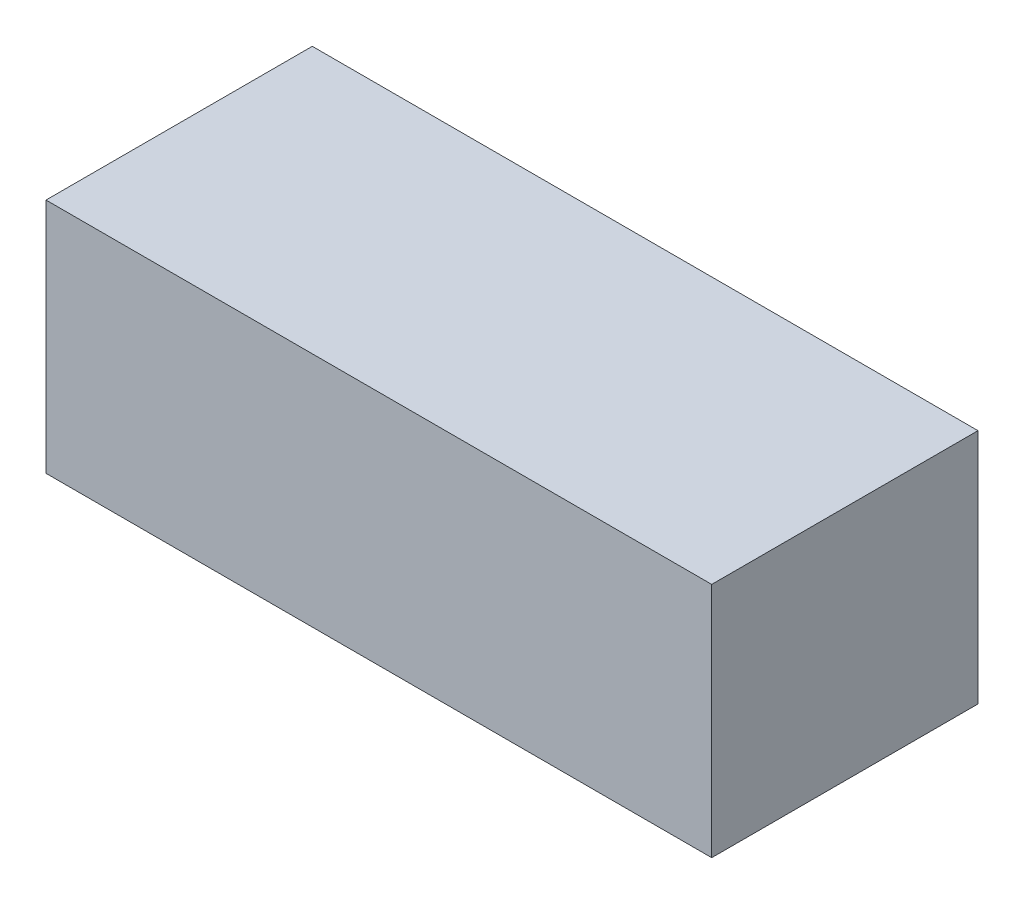
ISO-10303-21;
HEADER;
FILE_DESCRIPTION(('STEP AP214'),'2;1');
FILE_NAME('part.step','',(''),(''),'','','');
FILE_SCHEMA(('AUTOMOTIVE_DESIGN { 1 0 10303 214 1 1 1 1 }'));
ENDSEC;
DATA;
#1=APPLICATION_CONTEXT('core data for automotive mechanical design processes');
#2=APPLICATION_PROTOCOL_DEFINITION('international standard','automotive_design',2000,#1);
#3=PRODUCT_CONTEXT('',#1,'mechanical');
#4=PRODUCT('Part','Part','',(#3));
#5=PRODUCT_RELATED_PRODUCT_CATEGORY('part','',(#4));
#6=PRODUCT_DEFINITION_FORMATION('','',#4);
#7=PRODUCT_DEFINITION_CONTEXT('part definition',#1,'design');
#8=PRODUCT_DEFINITION('design','',#6,#7);
#9=PRODUCT_DEFINITION_SHAPE('','',#8);
#10=(LENGTH_UNIT() NAMED_UNIT(*) SI_UNIT(.MILLI.,.METRE.));
#11=(NAMED_UNIT(*) PLANE_ANGLE_UNIT() SI_UNIT($,.RADIAN.));
#12=(NAMED_UNIT(*) SI_UNIT($,.STERADIAN.) SOLID_ANGLE_UNIT());
#13=UNCERTAINTY_MEASURE_WITH_UNIT(LENGTH_MEASURE(1.E-05),#10,'distance_accuracy_value','');
#14=(GEOMETRIC_REPRESENTATION_CONTEXT(3) GLOBAL_UNCERTAINTY_ASSIGNED_CONTEXT((#13)) GLOBAL_UNIT_ASSIGNED_CONTEXT((#10,
#11,#12)) REPRESENTATION_CONTEXT('',''));
#15=CARTESIAN_POINT('',(0.,0.,0.));
#16=DIRECTION('',(0.,0.,1.));
#17=DIRECTION('',(1.,0.,0.));
#18=AXIS2_PLACEMENT_3D('',#15,#16,#17);
#19=CARTESIAN_POINT('',(2.251,-0.8,1.801));
#20=DIRECTION('',(0.,-1.,0.));
#21=DIRECTION('',(-1.,0.,0.));
#22=AXIS2_PLACEMENT_3D('',#19,#20,#21);
#23=PLANE('',#22);
#24=DIRECTION('',(0.,0.,1.));
#25=VECTOR('',#24,1.);
#26=CARTESIAN_POINT('',(-2.25,-0.8,0.9));
#27=LINE('',#26,#25);
#28=CARTESIAN_POINT('',(-2.25,-0.8,0.));
#29=VERTEX_POINT('',#28);
#30=CARTESIAN_POINT('',(-2.25,-0.8,1.8));
#31=VERTEX_POINT('',#30);
#32=EDGE_CURVE('E20',#29,#31,#27,.T.);
#33=ORIENTED_EDGE('',*,*,#32,.F.);
#34=DIRECTION('',(-1.,0.,0.));
#35=VECTOR('',#34,1.);
#36=CARTESIAN_POINT('',(0.,-0.8,0.));
#37=LINE('',#36,#35);
#38=CARTESIAN_POINT('',(2.25,-0.8,0.));
#39=VERTEX_POINT('',#38);
#40=EDGE_CURVE('E80',#39,#29,#37,.T.);
#41=ORIENTED_EDGE('',*,*,#40,.F.);
#42=DIRECTION('',(0.,0.,-1.));
#43=VECTOR('',#42,1.);
#44=CARTESIAN_POINT('',(2.25,-0.8,0.9));
#45=LINE('',#44,#43);
#46=CARTESIAN_POINT('',(2.25,-0.8,1.8));
#47=VERTEX_POINT('',#46);
#48=EDGE_CURVE('E68',#47,#39,#45,.T.);
#49=ORIENTED_EDGE('',*,*,#48,.F.);
#50=DIRECTION('',(1.,0.,0.));
#51=VECTOR('',#50,1.);
#52=CARTESIAN_POINT('',(0.,-0.8,1.8));
#53=LINE('',#52,#51);
#54=EDGE_CURVE('E55',#31,#47,#53,.T.);
#55=ORIENTED_EDGE('',*,*,#54,.F.);
#56=EDGE_LOOP('',(#33,#41,#49,#55));
#57=FACE_BOUND('',#56,.T.);
#58=ADVANCED_FACE('F16',(#57),#23,.T.);
#59=CARTESIAN_POINT('',(-2.25,-0.801,1.801));
#60=DIRECTION('',(-1.,0.,0.));
#61=DIRECTION('',(0.,1.,0.));
#62=AXIS2_PLACEMENT_3D('',#59,#60,#61);
#63=PLANE('',#62);
#64=DIRECTION('',(0.,0.,1.));
#65=VECTOR('',#64,1.);
#66=CARTESIAN_POINT('',(-2.25,0.8,0.9));
#67=LINE('',#66,#65);
#68=CARTESIAN_POINT('',(-2.25,0.8,0.));
#69=VERTEX_POINT('',#68);
#70=CARTESIAN_POINT('',(-2.25,0.8,1.8));
#71=VERTEX_POINT('',#70);
#72=EDGE_CURVE('E83',#69,#71,#67,.T.);
#73=ORIENTED_EDGE('',*,*,#72,.F.);
#74=DIRECTION('',(0.,1.,0.));
#75=VECTOR('',#74,1.);
#76=CARTESIAN_POINT('',(-2.25,0.,0.));
#77=LINE('',#76,#75);
#78=EDGE_CURVE('E64',#29,#69,#77,.T.);
#79=ORIENTED_EDGE('',*,*,#78,.F.);
#80=ORIENTED_EDGE('',*,*,#32,.T.);
#81=DIRECTION('',(0.,-1.,0.));
#82=VECTOR('',#81,1.);
#83=CARTESIAN_POINT('',(-2.25,0.,1.8));
#84=LINE('',#83,#82);
#85=EDGE_CURVE('E61',#71,#31,#84,.T.);
#86=ORIENTED_EDGE('',*,*,#85,.F.);
#87=EDGE_LOOP('',(#73,#79,#80,#86));
#88=FACE_BOUND('',#87,.T.);
#89=ADVANCED_FACE('F60',(#88),#63,.T.);
#90=CARTESIAN_POINT('',(-2.251,-0.801,1.8));
#91=DIRECTION('',(0.,0.,1.));
#92=DIRECTION('',(1.,0.,0.));
#93=AXIS2_PLACEMENT_3D('',#90,#91,#92);
#94=PLANE('',#93);
#95=ORIENTED_EDGE('',*,*,#54,.T.);
#96=DIRECTION('',(0.,-1.,0.));
#97=VECTOR('',#96,1.);
#98=CARTESIAN_POINT('',(2.25,0.,1.8));
#99=LINE('',#98,#97);
#100=CARTESIAN_POINT('',(2.25,0.8,1.8));
#101=VERTEX_POINT('',#100);
#102=EDGE_CURVE('E70',#101,#47,#99,.T.);
#103=ORIENTED_EDGE('',*,*,#102,.F.);
#104=DIRECTION('',(1.,0.,0.));
#105=VECTOR('',#104,1.);
#106=CARTESIAN_POINT('',(0.,0.8,1.8));
#107=LINE('',#106,#105);
#108=EDGE_CURVE('E74',#71,#101,#107,.T.);
#109=ORIENTED_EDGE('',*,*,#108,.F.);
#110=ORIENTED_EDGE('',*,*,#85,.T.);
#111=EDGE_LOOP('',(#95,#103,#109,#110));
#112=FACE_BOUND('',#111,.T.);
#113=ADVANCED_FACE('F72',(#112),#94,.T.);
#114=CARTESIAN_POINT('',(2.25,0.801,1.801));
#115=DIRECTION('',(1.,0.,0.));
#116=DIRECTION('',(0.,-1.,0.));
#117=AXIS2_PLACEMENT_3D('',#114,#115,#116);
#118=PLANE('',#117);
#119=ORIENTED_EDGE('',*,*,#48,.T.);
#120=DIRECTION('',(0.,-1.,0.));
#121=VECTOR('',#120,1.);
#122=CARTESIAN_POINT('',(2.25,0.,0.));
#123=LINE('',#122,#121);
#124=CARTESIAN_POINT('',(2.25,0.8,0.));
#125=VERTEX_POINT('',#124);
#126=EDGE_CURVE('E35',#125,#39,#123,.T.);
#127=ORIENTED_EDGE('',*,*,#126,.F.);
#128=DIRECTION('',(0.,0.,-1.));
#129=VECTOR('',#128,1.);
#130=CARTESIAN_POINT('',(2.25,0.8,0.9));
#131=LINE('',#130,#129);
#132=EDGE_CURVE('E26',#101,#125,#131,.T.);
#133=ORIENTED_EDGE('',*,*,#132,.F.);
#134=ORIENTED_EDGE('',*,*,#102,.T.);
#135=EDGE_LOOP('',(#119,#127,#133,#134));
#136=FACE_BOUND('',#135,.T.);
#137=ADVANCED_FACE('F88',(#136),#118,.T.);
#138=CARTESIAN_POINT('',(2.251,-0.801,0.));
#139=DIRECTION('',(0.,0.,-1.));
#140=DIRECTION('',(-1.,0.,0.));
#141=AXIS2_PLACEMENT_3D('',#138,#139,#140);
#142=PLANE('',#141);
#143=ORIENTED_EDGE('',*,*,#40,.T.);
#144=ORIENTED_EDGE('',*,*,#78,.T.);
#145=DIRECTION('',(-1.,0.,0.));
#146=VECTOR('',#145,1.);
#147=CARTESIAN_POINT('',(0.,0.8,0.));
#148=LINE('',#147,#146);
#149=EDGE_CURVE('E11',#125,#69,#148,.T.);
#150=ORIENTED_EDGE('',*,*,#149,.F.);
#151=ORIENTED_EDGE('',*,*,#126,.T.);
#152=EDGE_LOOP('',(#143,#144,#150,#151));
#153=FACE_BOUND('',#152,.T.);
#154=ADVANCED_FACE('F90',(#153),#142,.T.);
#155=CARTESIAN_POINT('',(-2.251,0.8,1.801));
#156=DIRECTION('',(0.,1.,0.));
#157=DIRECTION('',(1.,0.,0.));
#158=AXIS2_PLACEMENT_3D('',#155,#156,#157);
#159=PLANE('',#158);
#160=ORIENTED_EDGE('',*,*,#132,.T.);
#161=ORIENTED_EDGE('',*,*,#149,.T.);
#162=ORIENTED_EDGE('',*,*,#72,.T.);
#163=ORIENTED_EDGE('',*,*,#108,.T.);
#164=EDGE_LOOP('',(#160,#161,#162,#163));
#165=FACE_BOUND('',#164,.T.);
#166=ADVANCED_FACE('F18',(#165),#159,.T.);
#167=CLOSED_SHELL('',(#58,#89,#113,#137,#154,#166));
#168=MANIFOLD_SOLID_BREP('B1',#167);
#169=ADVANCED_BREP_SHAPE_REPRESENTATION('',(#18,#168),#14);
#170=SHAPE_DEFINITION_REPRESENTATION(#9,#169);
ENDSEC;
END-ISO-10303-21;
